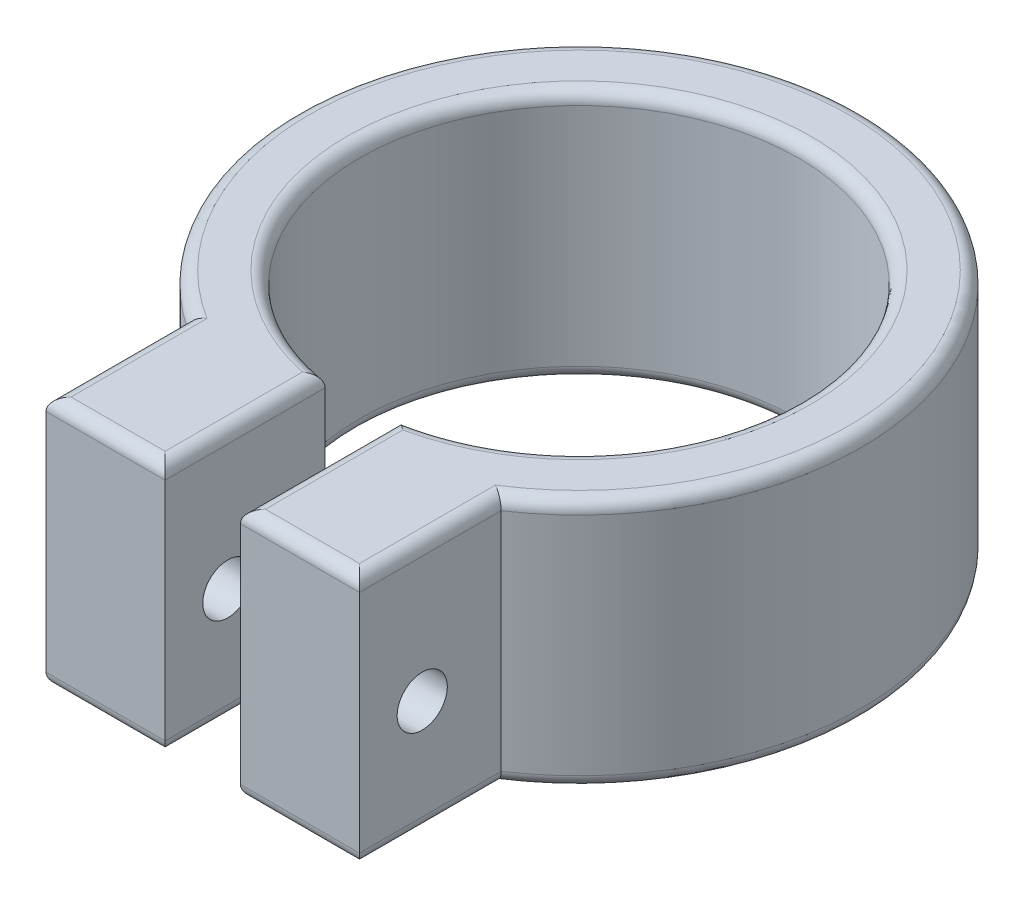
ISO-10303-21;
HEADER;
FILE_DESCRIPTION(('STEP AP214'),'2;1');
FILE_NAME('part.step','',(''),(''),'','','');
FILE_SCHEMA(('AUTOMOTIVE_DESIGN { 1 0 10303 214 1 1 1 1 }'));
ENDSEC;
DATA;
#1=APPLICATION_CONTEXT('core data for automotive mechanical design processes');
#2=APPLICATION_PROTOCOL_DEFINITION('international standard','automotive_design',2000,#1);
#3=PRODUCT_CONTEXT('',#1,'mechanical');
#4=PRODUCT('Part','Part','',(#3));
#5=PRODUCT_RELATED_PRODUCT_CATEGORY('part','',(#4));
#6=PRODUCT_DEFINITION_FORMATION('','',#4);
#7=PRODUCT_DEFINITION_CONTEXT('part definition',#1,'design');
#8=PRODUCT_DEFINITION('design','',#6,#7);
#9=PRODUCT_DEFINITION_SHAPE('','',#8);
#10=(LENGTH_UNIT() NAMED_UNIT(*) SI_UNIT(.MILLI.,.METRE.));
#11=(NAMED_UNIT(*) PLANE_ANGLE_UNIT() SI_UNIT($,.RADIAN.));
#12=(NAMED_UNIT(*) SI_UNIT($,.STERADIAN.) SOLID_ANGLE_UNIT());
#13=UNCERTAINTY_MEASURE_WITH_UNIT(LENGTH_MEASURE(1.E-05),#10,'distance_accuracy_value','');
#14=(GEOMETRIC_REPRESENTATION_CONTEXT(3) GLOBAL_UNCERTAINTY_ASSIGNED_CONTEXT((#13)) GLOBAL_UNIT_ASSIGNED_CONTEXT((#10,
#11,#12)) REPRESENTATION_CONTEXT('',''));
#15=CARTESIAN_POINT('',(0.,0.,0.));
#16=DIRECTION('',(0.,0.,1.));
#17=DIRECTION('',(1.,0.,0.));
#18=AXIS2_PLACEMENT_3D('',#15,#16,#17);
#19=CARTESIAN_POINT('',(22.5,20.,-30.));
#20=DIRECTION('',(0.,1.,0.));
#21=DIRECTION('',(0.,0.,1.));
#22=AXIS2_PLACEMENT_3D('',#19,#20,#21);
#23=PLANE('',#22);
#24=DIRECTION('',(1.,0.,0.));
#25=VECTOR('',#24,1.);
#26=CARTESIAN_POINT('',(19.5,20.,-1.));
#27=LINE('',#26,#25);
#28=CARTESIAN_POINT('',(11.,20.,-1.));
#29=VERTEX_POINT('',#28);
#30=CARTESIAN_POINT('',(18.5,20.,-1.));
#31=VERTEX_POINT('',#30);
#32=EDGE_CURVE('E443',#29,#31,#27,.T.);
#33=ORIENTED_EDGE('',*,*,#32,.T.);
#34=DIRECTION('',(0.,0.,1.));
#35=VECTOR('',#34,1.);
#36=CARTESIAN_POINT('',(18.5,20.,-12.7590603504333));
#37=LINE('',#36,#35);
#38=CARTESIAN_POINT('',(18.5,20.,-11.9376081318116));
#39=VERTEX_POINT('',#38);
#40=EDGE_CURVE('E381',#31,#39,#37,.F.);
#41=ORIENTED_EDGE('',*,*,#40,.T.);
#42=CARTESIAN_POINT('',(22.5,20.,-30.));
#43=DIRECTION('',(0.,1.,0.));
#44=DIRECTION('',(0.,0.,1.));
#45=AXIS2_PLACEMENT_3D('',#42,#43,#44);
#46=CIRCLE('',#45,18.5);
#47=CARTESIAN_POINT('',(26.5,20.,-11.9376081318116));
#48=VERTEX_POINT('',#47);
#49=EDGE_CURVE('E377',#39,#48,#46,.F.);
#50=ORIENTED_EDGE('',*,*,#49,.T.);
#51=DIRECTION('',(0.,0.,-1.));
#52=VECTOR('',#51,1.);
#53=CARTESIAN_POINT('',(26.5,20.,0.));
#54=LINE('',#53,#52);
#55=CARTESIAN_POINT('',(26.5,20.,-1.));
#56=VERTEX_POINT('',#55);
#57=EDGE_CURVE('E508',#48,#56,#54,.F.);
#58=ORIENTED_EDGE('',*,*,#57,.T.);
#59=DIRECTION('',(1.,0.,0.));
#60=VECTOR('',#59,1.);
#61=CARTESIAN_POINT('',(35.,20.,-1.));
#62=LINE('',#61,#60);
#63=CARTESIAN_POINT('',(34.,20.,-1.));
#64=VERTEX_POINT('',#63);
#65=EDGE_CURVE('E506',#56,#64,#62,.T.);
#66=ORIENTED_EDGE('',*,*,#65,.T.);
#67=DIRECTION('',(0.,0.,-1.));
#68=VECTOR('',#67,1.);
#69=CARTESIAN_POINT('',(34.,20.,-30.));
#70=LINE('',#69,#68);
#71=CARTESIAN_POINT('',(34.,20.,-11.8340978754151));
#72=VERTEX_POINT('',#71);
#73=EDGE_CURVE('E501',#64,#72,#70,.T.);
#74=ORIENTED_EDGE('',*,*,#73,.T.);
#75=CARTESIAN_POINT('',(22.5,20.,-30.));
#76=DIRECTION('',(0.,1.,0.));
#77=DIRECTION('',(0.,0.,1.));
#78=AXIS2_PLACEMENT_3D('',#75,#76,#77);
#79=CIRCLE('',#78,21.5);
#80=CARTESIAN_POINT('',(11.,20.,-11.834097875415));
#81=VERTEX_POINT('',#80);
#82=EDGE_CURVE('E495',#72,#81,#79,.T.);
#83=ORIENTED_EDGE('',*,*,#82,.T.);
#84=DIRECTION('',(0.,0.,-1.));
#85=VECTOR('',#84,1.);
#86=CARTESIAN_POINT('',(11.,20.,0.));
#87=LINE('',#86,#85);
#88=EDGE_CURVE('E499',#81,#29,#87,.F.);
#89=ORIENTED_EDGE('',*,*,#88,.T.);
#90=EDGE_LOOP('',(#33,#41,#50,#58,#66,#74,#83,#89));
#91=FACE_BOUND('',#90,.T.);
#92=ADVANCED_FACE('F51',(#91),#23,.T.);
#93=CARTESIAN_POINT('',(22.5,0.,-30.));
#94=DIRECTION('',(0.,1.,0.));
#95=DIRECTION('',(0.,0.,1.));
#96=AXIS2_PLACEMENT_3D('',#93,#94,#95);
#97=PLANE('',#96);
#98=DIRECTION('',(1.,0.,0.));
#99=VECTOR('',#98,1.);
#100=CARTESIAN_POINT('',(22.5,0.,-1.));
#101=LINE('',#100,#99);
#102=CARTESIAN_POINT('',(18.5,0.,-1.));
#103=VERTEX_POINT('',#102);
#104=CARTESIAN_POINT('',(11.,0.,-1.));
#105=VERTEX_POINT('',#104);
#106=EDGE_CURVE('E488',#103,#105,#101,.F.);
#107=ORIENTED_EDGE('',*,*,#106,.T.);
#108=DIRECTION('',(0.,0.,-1.));
#109=VECTOR('',#108,1.);
#110=CARTESIAN_POINT('',(11.,0.,-30.));
#111=LINE('',#110,#109);
#112=CARTESIAN_POINT('',(11.,0.,-11.834097875415));
#113=VERTEX_POINT('',#112);
#114=EDGE_CURVE('E493',#105,#113,#111,.T.);
#115=ORIENTED_EDGE('',*,*,#114,.T.);
#116=CARTESIAN_POINT('',(22.5,0.,-30.));
#117=DIRECTION('',(0.,1.,0.));
#118=DIRECTION('',(0.,0.,1.));
#119=AXIS2_PLACEMENT_3D('',#116,#117,#118);
#120=CIRCLE('',#119,21.5);
#121=CARTESIAN_POINT('',(34.,0.,-11.8340978754151));
#122=VERTEX_POINT('',#121);
#123=EDGE_CURVE('E483',#113,#122,#120,.F.);
#124=ORIENTED_EDGE('',*,*,#123,.T.);
#125=DIRECTION('',(0.,0.,-1.));
#126=VECTOR('',#125,1.);
#127=CARTESIAN_POINT('',(34.,0.,0.));
#128=LINE('',#127,#126);
#129=CARTESIAN_POINT('',(34.,0.,-1.));
#130=VERTEX_POINT('',#129);
#131=EDGE_CURVE('E222',#122,#130,#128,.F.);
#132=ORIENTED_EDGE('',*,*,#131,.T.);
#133=DIRECTION('',(1.,0.,0.));
#134=VECTOR('',#133,1.);
#135=CARTESIAN_POINT('',(22.5,0.,-1.));
#136=LINE('',#135,#134);
#137=CARTESIAN_POINT('',(26.5,0.,-1.));
#138=VERTEX_POINT('',#137);
#139=EDGE_CURVE('E196',#130,#138,#136,.F.);
#140=ORIENTED_EDGE('',*,*,#139,.T.);
#141=DIRECTION('',(0.,0.,-1.));
#142=VECTOR('',#141,1.);
#143=CARTESIAN_POINT('',(26.5,0.,-30.));
#144=LINE('',#143,#142);
#145=CARTESIAN_POINT('',(26.5,0.,-11.9376081318116));
#146=VERTEX_POINT('',#145);
#147=EDGE_CURVE('E211',#138,#146,#144,.T.);
#148=ORIENTED_EDGE('',*,*,#147,.T.);
#149=CARTESIAN_POINT('',(22.5,0.,-30.));
#150=DIRECTION('',(0.,1.,0.));
#151=DIRECTION('',(0.,0.,1.));
#152=AXIS2_PLACEMENT_3D('',#149,#150,#151);
#153=CIRCLE('',#152,18.5);
#154=CARTESIAN_POINT('',(18.5,0.,-11.9376081318115));
#155=VERTEX_POINT('',#154);
#156=EDGE_CURVE('E218',#146,#155,#153,.T.);
#157=ORIENTED_EDGE('',*,*,#156,.T.);
#158=DIRECTION('',(0.,0.,1.));
#159=VECTOR('',#158,1.);
#160=CARTESIAN_POINT('',(18.5,0.,-30.));
#161=LINE('',#160,#159);
#162=EDGE_CURVE('E486',#155,#103,#161,.T.);
#163=ORIENTED_EDGE('',*,*,#162,.T.);
#164=EDGE_LOOP('',(#107,#115,#124,#132,#140,#148,#157,#163));
#165=FACE_BOUND('',#164,.T.);
#166=ADVANCED_FACE('F480',(#165),#97,.F.);
#167=CARTESIAN_POINT('',(0.,20.,0.));
#168=DIRECTION('',(0.,0.,-1.));
#169=DIRECTION('',(-1.,0.,0.));
#170=AXIS2_PLACEMENT_3D('',#167,#168,#169);
#171=PLANE('',#170);
#172=DIRECTION('',(0.,1.,0.));
#173=VECTOR('',#172,1.);
#174=CARTESIAN_POINT('',(25.5,0.,0.));
#175=LINE('',#174,#173);
#176=CARTESIAN_POINT('',(25.5,1.,0.));
#177=VERTEX_POINT('',#176);
#178=CARTESIAN_POINT('',(25.5,19.,0.));
#179=VERTEX_POINT('',#178);
#180=EDGE_CURVE('E174',#177,#179,#175,.T.);
#181=ORIENTED_EDGE('',*,*,#180,.F.);
#182=DIRECTION('',(1.,0.,0.));
#183=VECTOR('',#182,1.);
#184=CARTESIAN_POINT('',(0.,1.,0.));
#185=LINE('',#184,#183);
#186=CARTESIAN_POINT('',(35.,1.,0.));
#187=VERTEX_POINT('',#186);
#188=EDGE_CURVE('E13',#177,#187,#185,.T.);
#189=ORIENTED_EDGE('',*,*,#188,.T.);
#190=DIRECTION('',(0.,1.,0.));
#191=VECTOR('',#190,1.);
#192=CARTESIAN_POINT('',(35.,0.,0.));
#193=LINE('',#192,#191);
#194=CARTESIAN_POINT('',(35.,19.,0.));
#195=VERTEX_POINT('',#194);
#196=EDGE_CURVE('E173',#187,#195,#193,.T.);
#197=ORIENTED_EDGE('',*,*,#196,.T.);
#198=DIRECTION('',(1.,0.,0.));
#199=VECTOR('',#198,1.);
#200=CARTESIAN_POINT('',(25.5,19.,0.));
#201=LINE('',#200,#199);
#202=EDGE_CURVE('E67',#195,#179,#201,.F.);
#203=ORIENTED_EDGE('',*,*,#202,.T.);
#204=EDGE_LOOP('',(#181,#189,#197,#203));
#205=FACE_BOUND('',#204,.T.);
#206=ADVANCED_FACE('F172',(#205),#171,.F.);
#207=DIRECTION('',(0.,1.,0.));
#208=VECTOR('',#207,1.);
#209=CARTESIAN_POINT('',(10.,0.,0.));
#210=LINE('',#209,#208);
#211=CARTESIAN_POINT('',(10.,1.,0.));
#212=VERTEX_POINT('',#211);
#213=CARTESIAN_POINT('',(10.,19.,0.));
#214=VERTEX_POINT('',#213);
#215=EDGE_CURVE('E415',#212,#214,#210,.T.);
#216=ORIENTED_EDGE('',*,*,#215,.F.);
#217=DIRECTION('',(1.,0.,0.));
#218=VECTOR('',#217,1.);
#219=CARTESIAN_POINT('',(0.,1.,0.));
#220=LINE('',#219,#218);
#221=CARTESIAN_POINT('',(19.5,1.,0.));
#222=VERTEX_POINT('',#221);
#223=EDGE_CURVE('E460',#212,#222,#220,.T.);
#224=ORIENTED_EDGE('',*,*,#223,.T.);
#225=DIRECTION('',(0.,1.,0.));
#226=VECTOR('',#225,1.);
#227=CARTESIAN_POINT('',(19.5,0.,0.));
#228=LINE('',#227,#226);
#229=CARTESIAN_POINT('',(19.5,19.,0.));
#230=VERTEX_POINT('',#229);
#231=EDGE_CURVE('E412',#222,#230,#228,.T.);
#232=ORIENTED_EDGE('',*,*,#231,.T.);
#233=DIRECTION('',(1.,0.,0.));
#234=VECTOR('',#233,1.);
#235=CARTESIAN_POINT('',(10.,19.,0.));
#236=LINE('',#235,#234);
#237=EDGE_CURVE('E457',#230,#214,#236,.F.);
#238=ORIENTED_EDGE('',*,*,#237,.T.);
#239=EDGE_LOOP('',(#216,#224,#232,#238));
#240=FACE_BOUND('',#239,.T.);
#241=ADVANCED_FACE('F558',(#240),#171,.F.);
#242=CARTESIAN_POINT('',(22.5,20.,-30.));
#243=DIRECTION('',(0.,-1.,0.));
#244=DIRECTION('',(0.,0.,-1.));
#245=AXIS2_PLACEMENT_3D('',#242,#243,#244);
#246=CYLINDRICAL_SURFACE('',#245,22.5);
#247=DIRECTION('',(0.,1.,0.));
#248=VECTOR('',#247,1.);
#249=CARTESIAN_POINT('',(35.,0.,-11.2917130661303));
#250=LINE('',#249,#248);
#251=CARTESIAN_POINT('',(35.,1.,-11.2917130661303));
#252=VERTEX_POINT('',#251);
#253=CARTESIAN_POINT('',(35.,19.,-11.2917130661303));
#254=VERTEX_POINT('',#253);
#255=EDGE_CURVE('E191',#252,#254,#250,.T.);
#256=ORIENTED_EDGE('',*,*,#255,.F.);
#257=CARTESIAN_POINT('',(22.5,1.,-30.));
#258=DIRECTION('',(0.,1.,0.));
#259=DIRECTION('',(0.,0.,1.));
#260=AXIS2_PLACEMENT_3D('',#257,#258,#259);
#261=CIRCLE('',#260,22.5);
#262=CARTESIAN_POINT('',(10.,1.,-11.2917130661303));
#263=VERTEX_POINT('',#262);
#264=EDGE_CURVE('E233',#252,#263,#261,.T.);
#265=ORIENTED_EDGE('',*,*,#264,.T.);
#266=DIRECTION('',(0.,1.,0.));
#267=VECTOR('',#266,1.);
#268=CARTESIAN_POINT('',(10.,0.,-11.2917130661303));
#269=LINE('',#268,#267);
#270=CARTESIAN_POINT('',(10.,19.,-11.2917130661303));
#271=VERTEX_POINT('',#270);
#272=EDGE_CURVE('E190',#263,#271,#269,.T.);
#273=ORIENTED_EDGE('',*,*,#272,.T.);
#274=CARTESIAN_POINT('',(22.5,19.,-30.));
#275=DIRECTION('',(0.,1.,0.));
#276=DIRECTION('',(0.,0.,1.));
#277=AXIS2_PLACEMENT_3D('',#274,#275,#276);
#278=CIRCLE('',#277,22.5);
#279=EDGE_CURVE('E238',#271,#254,#278,.F.);
#280=ORIENTED_EDGE('',*,*,#279,.T.);
#281=EDGE_LOOP('',(#256,#265,#273,#280));
#282=FACE_BOUND('',#281,.T.);
#283=ADVANCED_FACE('F559',(#282),#246,.T.);
#284=CARTESIAN_POINT('',(22.5,20.,-30.));
#285=DIRECTION('',(0.,-1.,0.));
#286=DIRECTION('',(0.,0.,-1.));
#287=AXIS2_PLACEMENT_3D('',#284,#285,#286);
#288=CYLINDRICAL_SURFACE('',#287,17.5);
#289=DIRECTION('',(0.,1.,0.));
#290=VECTOR('',#289,1.);
#291=CARTESIAN_POINT('',(19.5,0.,-12.7590603504333));
#292=LINE('',#291,#290);
#293=CARTESIAN_POINT('',(19.5,1.,-12.7590603504333));
#294=VERTEX_POINT('',#293);
#295=CARTESIAN_POINT('',(19.5,19.,-12.7590603504333));
#296=VERTEX_POINT('',#295);
#297=EDGE_CURVE('E213',#294,#296,#292,.T.);
#298=ORIENTED_EDGE('',*,*,#297,.F.);
#299=CARTESIAN_POINT('',(22.5,1.,-30.));
#300=DIRECTION('',(0.,1.,0.));
#301=DIRECTION('',(0.,0.,1.));
#302=AXIS2_PLACEMENT_3D('',#299,#300,#301);
#303=CIRCLE('',#302,17.5);
#304=CARTESIAN_POINT('',(25.5,1.,-12.7590603504333));
#305=VERTEX_POINT('',#304);
#306=EDGE_CURVE('E465',#294,#305,#303,.F.);
#307=ORIENTED_EDGE('',*,*,#306,.T.);
#308=DIRECTION('',(0.,1.,0.));
#309=VECTOR('',#308,1.);
#310=CARTESIAN_POINT('',(25.5,0.,-12.7590603504333));
#311=LINE('',#310,#309);
#312=CARTESIAN_POINT('',(25.5,19.,-12.7590603504333));
#313=VERTEX_POINT('',#312);
#314=EDGE_CURVE('E404',#305,#313,#311,.T.);
#315=ORIENTED_EDGE('',*,*,#314,.T.);
#316=CARTESIAN_POINT('',(22.5,19.,-30.));
#317=DIRECTION('',(0.,1.,0.));
#318=DIRECTION('',(0.,0.,1.));
#319=AXIS2_PLACEMENT_3D('',#316,#317,#318);
#320=CIRCLE('',#319,17.5);
#321=EDGE_CURVE('E376',#313,#296,#320,.T.);
#322=ORIENTED_EDGE('',*,*,#321,.T.);
#323=EDGE_LOOP('',(#298,#307,#315,#322));
#324=FACE_BOUND('',#323,.T.);
#325=ADVANCED_FACE('F471',(#324),#288,.F.);
#326=CARTESIAN_POINT('',(25.5,0.,0.));
#327=DIRECTION('',(1.,0.,0.));
#328=DIRECTION('',(0.,0.,-1.));
#329=AXIS2_PLACEMENT_3D('',#326,#327,#328);
#330=PLANE('',#329);
#331=CARTESIAN_POINT('',(25.5,9.,-5.));
#332=DIRECTION('',(1.,0.,0.));
#333=DIRECTION('',(0.,0.,-1.));
#334=AXIS2_PLACEMENT_3D('',#331,#332,#333);
#335=CIRCLE('',#334,2.);
#336=CARTESIAN_POINT('',(25.5,9.,-7.));
#337=VERTEX_POINT('',#336);
#338=EDGE_CURVE('E428',#337,#337,#335,.T.);
#339=ORIENTED_EDGE('',*,*,#338,.T.);
#340=EDGE_LOOP('',(#339));
#341=FACE_BOUND('',#340,.T.);
#342=ORIENTED_EDGE('',*,*,#180,.T.);
#343=DIRECTION('',(0.,0.,-1.));
#344=VECTOR('',#343,1.);
#345=CARTESIAN_POINT('',(25.5,19.,-12.7590603504333));
#346=LINE('',#345,#344);
#347=EDGE_CURVE('E389',#179,#313,#346,.T.);
#348=ORIENTED_EDGE('',*,*,#347,.T.);
#349=ORIENTED_EDGE('',*,*,#314,.F.);
#350=DIRECTION('',(0.,0.,-1.));
#351=VECTOR('',#350,1.);
#352=CARTESIAN_POINT('',(25.5,1.,0.));
#353=LINE('',#352,#351);
#354=EDGE_CURVE('E81',#305,#177,#353,.F.);
#355=ORIENTED_EDGE('',*,*,#354,.T.);
#356=EDGE_LOOP('',(#342,#348,#349,#355));
#357=FACE_BOUND('',#356,.T.);
#358=ADVANCED_FACE('F474',(#341,#357),#330,.F.);
#359=CARTESIAN_POINT('',(19.5,0.,0.));
#360=DIRECTION('',(-1.,0.,0.));
#361=DIRECTION('',(0.,0.,1.));
#362=AXIS2_PLACEMENT_3D('',#359,#360,#361);
#363=PLANE('',#362);
#364=CARTESIAN_POINT('',(19.5,9.,-5.));
#365=DIRECTION('',(-1.,0.,0.));
#366=DIRECTION('',(0.,0.,1.));
#367=AXIS2_PLACEMENT_3D('',#364,#365,#366);
#368=CIRCLE('',#367,2.);
#369=CARTESIAN_POINT('',(19.5,9.,-3.));
#370=VERTEX_POINT('',#369);
#371=EDGE_CURVE('E432',#370,#370,#368,.T.);
#372=ORIENTED_EDGE('',*,*,#371,.T.);
#373=EDGE_LOOP('',(#372));
#374=FACE_BOUND('',#373,.T.);
#375=ORIENTED_EDGE('',*,*,#231,.F.);
#376=DIRECTION('',(0.,0.,1.));
#377=VECTOR('',#376,1.);
#378=CARTESIAN_POINT('',(19.5,1.,0.));
#379=LINE('',#378,#377);
#380=EDGE_CURVE('E388',#222,#294,#379,.F.);
#381=ORIENTED_EDGE('',*,*,#380,.T.);
#382=ORIENTED_EDGE('',*,*,#297,.T.);
#383=DIRECTION('',(0.,0.,1.));
#384=VECTOR('',#383,1.);
#385=CARTESIAN_POINT('',(19.5,19.,0.));
#386=LINE('',#385,#384);
#387=EDGE_CURVE('E382',#296,#230,#386,.T.);
#388=ORIENTED_EDGE('',*,*,#387,.T.);
#389=EDGE_LOOP('',(#375,#381,#382,#388));
#390=FACE_BOUND('',#389,.T.);
#391=ADVANCED_FACE('F544',(#374,#390),#363,.F.);
#392=CARTESIAN_POINT('',(10.,0.,0.));
#393=DIRECTION('',(1.,0.,0.));
#394=DIRECTION('',(0.,0.,-1.));
#395=AXIS2_PLACEMENT_3D('',#392,#393,#394);
#396=PLANE('',#395);
#397=CARTESIAN_POINT('',(10.,9.,-5.));
#398=DIRECTION('',(1.,0.,0.));
#399=DIRECTION('',(0.,0.,-1.));
#400=AXIS2_PLACEMENT_3D('',#397,#398,#399);
#401=CIRCLE('',#400,2.);
#402=CARTESIAN_POINT('',(10.,9.,-7.));
#403=VERTEX_POINT('',#402);
#404=EDGE_CURVE('E436',#403,#403,#401,.T.);
#405=ORIENTED_EDGE('',*,*,#404,.T.);
#406=EDGE_LOOP('',(#405));
#407=FACE_BOUND('',#406,.T.);
#408=ORIENTED_EDGE('',*,*,#272,.F.);
#409=DIRECTION('',(0.,0.,-1.));
#410=VECTOR('',#409,1.);
#411=CARTESIAN_POINT('',(10.,1.,0.));
#412=LINE('',#411,#410);
#413=EDGE_CURVE('E454',#263,#212,#412,.F.);
#414=ORIENTED_EDGE('',*,*,#413,.T.);
#415=ORIENTED_EDGE('',*,*,#215,.T.);
#416=DIRECTION('',(0.,0.,-1.));
#417=VECTOR('',#416,1.);
#418=CARTESIAN_POINT('',(10.,19.,-11.2917130661303));
#419=LINE('',#418,#417);
#420=EDGE_CURVE('E450',#214,#271,#419,.T.);
#421=ORIENTED_EDGE('',*,*,#420,.T.);
#422=EDGE_LOOP('',(#408,#414,#415,#421));
#423=FACE_BOUND('',#422,.T.);
#424=ADVANCED_FACE('F539',(#407,#423),#396,.F.);
#425=CARTESIAN_POINT('',(35.,0.,0.));
#426=DIRECTION('',(1.,0.,0.));
#427=DIRECTION('',(0.,0.,-1.));
#428=AXIS2_PLACEMENT_3D('',#425,#426,#427);
#429=PLANE('',#428);
#430=CARTESIAN_POINT('',(35.,9.,-5.));
#431=DIRECTION('',(1.,0.,0.));
#432=DIRECTION('',(0.,0.,-1.));
#433=AXIS2_PLACEMENT_3D('',#430,#431,#432);
#434=CIRCLE('',#433,2.);
#435=CARTESIAN_POINT('',(35.,9.,-7.));
#436=VERTEX_POINT('',#435);
#437=EDGE_CURVE('E441',#436,#436,#434,.T.);
#438=ORIENTED_EDGE('',*,*,#437,.F.);
#439=EDGE_LOOP('',(#438));
#440=FACE_BOUND('',#439,.T.);
#441=ORIENTED_EDGE('',*,*,#196,.F.);
#442=DIRECTION('',(0.,0.,-1.));
#443=VECTOR('',#442,1.);
#444=CARTESIAN_POINT('',(35.,1.,-11.2917130661303));
#445=LINE('',#444,#443);
#446=EDGE_CURVE('E185',#187,#252,#445,.T.);
#447=ORIENTED_EDGE('',*,*,#446,.T.);
#448=ORIENTED_EDGE('',*,*,#255,.T.);
#449=DIRECTION('',(0.,0.,-1.));
#450=VECTOR('',#449,1.);
#451=CARTESIAN_POINT('',(35.,19.,0.));
#452=LINE('',#451,#450);
#453=EDGE_CURVE('E188',#254,#195,#452,.F.);
#454=ORIENTED_EDGE('',*,*,#453,.T.);
#455=EDGE_LOOP('',(#441,#447,#448,#454));
#456=FACE_BOUND('',#455,.T.);
#457=ADVANCED_FACE('F182',(#440,#456),#429,.T.);
#458=CARTESIAN_POINT('',(18.5,1.,-30.));
#459=DIRECTION('',(0.,0.,1.));
#460=DIRECTION('',(1.,0.,0.));
#461=AXIS2_PLACEMENT_3D('',#458,#459,#460);
#462=CYLINDRICAL_SURFACE('',#461,1.);
#463=CARTESIAN_POINT('',(18.5,1.,-1.));
#464=DIRECTION('',(-0.707106781186547,0.,0.707106781186547));
#465=DIRECTION('',(0.707106781186547,0.,0.707106781186547));
#466=AXIS2_PLACEMENT_3D('',#463,#464,#465);
#467=ELLIPSE('',#466,1.41421356237309,1.);
#468=EDGE_CURVE('E285',#103,#222,#467,.T.);
#469=ORIENTED_EDGE('',*,*,#468,.F.);
#470=ORIENTED_EDGE('',*,*,#162,.F.);
#471=CARTESIAN_POINT('',(19.5,1.,-12.7590603504333));
#472=CARTESIAN_POINT('',(19.5000025658507,0.976449769797416,-12.7590626497976));
#473=CARTESIAN_POINT('',(19.4991673909643,0.952913138809122,-12.7583600959621));
#474=CARTESIAN_POINT('',(19.4958537268471,0.906052324938436,-12.7555735123984));
#475=CARTESIAN_POINT('',(19.493376244743,0.882728020729837,-12.7534903293261));
#476=CARTESIAN_POINT('',(19.4835791351943,0.813675436744314,-12.7452546686449));
#477=CARTESIAN_POINT('',(19.4738936773669,0.768488128191731,-12.737115063092));
#478=CARTESIAN_POINT('',(19.4488594271133,0.681038909015151,-12.7161004273433));
#479=CARTESIAN_POINT('',(19.4335223050801,0.638771181686502,-12.7032351555762));
#480=CARTESIAN_POINT('',(19.3980003135747,0.557783167417089,-12.6734823864909));
#481=CARTESIAN_POINT('',(19.377806523937,0.519069591245115,-12.6565874884997));
#482=CARTESIAN_POINT('',(19.3260331042962,0.433488677976039,-12.6133486260151));
#483=CARTESIAN_POINT('',(19.2929017545144,0.388203278029624,-12.5857320140369));
#484=CARTESIAN_POINT('',(19.2213441214772,0.305251866450627,-12.5262508566829));
#485=CARTESIAN_POINT('',(19.1829091175301,0.267598661358038,-12.494379317883));
#486=CARTESIAN_POINT('',(19.0910202689877,0.190546901669668,-12.4184125112253));
#487=CARTESIAN_POINT('',(19.0363495046644,0.153536299896097,-12.3733717350668));
#488=CARTESIAN_POINT('',(18.9229325110231,0.0915340661668184,-12.2803180881187));
#489=CARTESIAN_POINT('',(18.8641838046828,0.0665498136578796,-12.232303412865));
#490=CARTESIAN_POINT('',(18.7554269901498,0.0318143816189406,-12.1437909462707));
#491=CARTESIAN_POINT('',(18.7058185017399,0.0200974359410088,-12.1035505306955));
#492=CARTESIAN_POINT('',(18.6058122334049,0.00433016441434542,-12.0227067403859));
#493=CARTESIAN_POINT('',(18.5554162832088,0.000264146667052162,-11.9821042805311));
#494=CARTESIAN_POINT('',(18.5033274534333,4.15173117882072E-06,-11.9402794687239));
#495=CARTESIAN_POINT('',(18.5016637351532,-2.65108599427396E-10,-11.9389437324615));
#496=CARTESIAN_POINT('',(18.5,0.,-11.9376081318115));
#497=B_SPLINE_CURVE_WITH_KNOTS('',3,(#471,#472,#473,#474,#475,#476,#477,#478,#479,#480,#481,
#482,#483,#484,#485,#486,#487,#488,#489,#490,#491,#492,#493,#494,#495,#496),.UNSPECIFIED.,.F.,
.F.,(4,2,2,2,2,2,2,2,2,2,2,2,4),(0.,0.0705994498664318,0.141155645397856,0.281146900307328,
0.420850685798021,0.560813049375829,0.74741644311827,0.934330404641157,1.17284634935761,
1.41150846304465,1.60590893791551,1.79991026490768,1.80631098819992),.UNSPECIFIED.);
#498=EDGE_CURVE('E298',#294,#155,#497,.T.);
#499=ORIENTED_EDGE('',*,*,#498,.F.);
#500=ORIENTED_EDGE('',*,*,#380,.F.);
#501=EDGE_LOOP('',(#469,#470,#499,#500));
#502=FACE_BOUND('',#501,.T.);
#503=ADVANCED_FACE('F294',(#502),#462,.T.);
#504=CARTESIAN_POINT('',(22.5,1.,-30.));
#505=DIRECTION('',(0.,1.,0.));
#506=DIRECTION('',(0.,0.,1.));
#507=AXIS2_PLACEMENT_3D('',#504,#505,#506);
#508=TOROIDAL_SURFACE('',#507,18.5,1.);
#509=ORIENTED_EDGE('',*,*,#498,.T.);
#510=ORIENTED_EDGE('',*,*,#156,.F.);
#511=CARTESIAN_POINT('',(25.5,1.,-12.7590603504333));
#512=CARTESIAN_POINT('',(25.4999974341493,0.976449769797416,-12.7590626497976));
#513=CARTESIAN_POINT('',(25.5008326090357,0.952913138809123,-12.7583600959621));
#514=CARTESIAN_POINT('',(25.5041462731529,0.906052324938436,-12.7555735123985));
#515=CARTESIAN_POINT('',(25.506623755257,0.882728020729837,-12.7534903293261));
#516=CARTESIAN_POINT('',(25.5164208648057,0.813675436744313,-12.7452546686449));
#517=CARTESIAN_POINT('',(25.5261063226331,0.76848812819173,-12.737115063092));
#518=CARTESIAN_POINT('',(25.5511405728867,0.68103890901515,-12.7161004273433));
#519=CARTESIAN_POINT('',(25.5664776949199,0.638771181686502,-12.7032351555762));
#520=CARTESIAN_POINT('',(25.6019996864253,0.557783167417089,-12.6734823864909));
#521=CARTESIAN_POINT('',(25.622193476063,0.519069591245115,-12.6565874884997));
#522=CARTESIAN_POINT('',(25.6739668957038,0.433488677976038,-12.6133486260151));
#523=CARTESIAN_POINT('',(25.7070982454856,0.388203278029621,-12.585732014037));
#524=CARTESIAN_POINT('',(25.7786558785227,0.305251866450625,-12.5262508566829));
#525=CARTESIAN_POINT('',(25.8170908824699,0.267598661358038,-12.494379317883));
#526=CARTESIAN_POINT('',(25.9089797310123,0.19054690166967,-12.4184125112253));
#527=CARTESIAN_POINT('',(25.9636504953356,0.153536299896098,-12.3733717350669));
#528=CARTESIAN_POINT('',(26.0770674889769,0.0915340661668187,-12.2803180881187));
#529=CARTESIAN_POINT('',(26.1358161953172,0.0665498136578799,-12.232303412865));
#530=CARTESIAN_POINT('',(26.2445730098502,0.0318143816189409,-12.1437909462708));
#531=CARTESIAN_POINT('',(26.2941814982601,0.0200974359410088,-12.1035505306956));
#532=CARTESIAN_POINT('',(26.394187766595,0.00433016441434587,-12.0227067403859));
#533=CARTESIAN_POINT('',(26.444583716791,0.000264146667053343,-11.9821042805309));
#534=CARTESIAN_POINT('',(26.4966725465667,4.15173117889514E-06,-11.9402794687239));
#535=CARTESIAN_POINT('',(26.4983362648468,-2.65108562237526E-10,-11.9389437324615));
#536=CARTESIAN_POINT('',(26.5,0.,-11.9376081318116));
#537=B_SPLINE_CURVE_WITH_KNOTS('',3,(#511,#512,#513,#514,#515,#516,#517,#518,#519,#520,#521,
#522,#523,#524,#525,#526,#527,#528,#529,#530,#531,#532,#533,#534,#535,#536),.UNSPECIFIED.,.F.,
.F.,(4,2,2,2,2,2,2,2,2,2,2,2,4),(0.,0.0705994498664313,0.141155645397856,0.281146900307328,
0.420850685798022,0.56081304937583,0.747416443118274,0.934330404641158,1.17284634935761,
1.41150846304465,1.60590893791551,1.79991026490768,1.80631098819992),.UNSPECIFIED.);
#538=EDGE_CURVE('E275',#305,#146,#537,.T.);
#539=ORIENTED_EDGE('',*,*,#538,.F.);
#540=ORIENTED_EDGE('',*,*,#306,.F.);
#541=EDGE_LOOP('',(#509,#510,#539,#540));
#542=FACE_BOUND('',#541,.T.);
#543=ADVANCED_FACE('F289',(#542),#508,.T.);
#544=CARTESIAN_POINT('',(0.,1.,-1.));
#545=DIRECTION('',(1.,0.,0.));
#546=DIRECTION('',(0.,0.,-1.));
#547=AXIS2_PLACEMENT_3D('',#544,#545,#546);
#548=CYLINDRICAL_SURFACE('',#547,1.);
#549=ORIENTED_EDGE('',*,*,#468,.T.);
#550=ORIENTED_EDGE('',*,*,#223,.F.);
#551=CARTESIAN_POINT('',(11.,1.,-1.));
#552=DIRECTION('',(0.707106781186547,0.,0.707106781186547));
#553=DIRECTION('',(0.707106781186547,0.,-0.707106781186547));
#554=AXIS2_PLACEMENT_3D('',#551,#552,#553);
#555=ELLIPSE('',#554,1.41421356237309,1.);
#556=EDGE_CURVE('E271',#105,#212,#555,.F.);
#557=ORIENTED_EDGE('',*,*,#556,.F.);
#558=ORIENTED_EDGE('',*,*,#106,.F.);
#559=EDGE_LOOP('',(#549,#550,#557,#558));
#560=FACE_BOUND('',#559,.T.);
#561=ADVANCED_FACE('F293',(#560),#548,.T.);
#562=CARTESIAN_POINT('',(26.5,1.,-30.));
#563=DIRECTION('',(0.,0.,-1.));
#564=DIRECTION('',(-1.,0.,0.));
#565=AXIS2_PLACEMENT_3D('',#562,#563,#564);
#566=CYLINDRICAL_SURFACE('',#565,1.);
#567=ORIENTED_EDGE('',*,*,#538,.T.);
#568=ORIENTED_EDGE('',*,*,#147,.F.);
#569=CARTESIAN_POINT('',(26.5,1.,-1.));
#570=DIRECTION('',(0.707106781186547,0.,0.707106781186547));
#571=DIRECTION('',(0.707106781186547,0.,-0.707106781186547));
#572=AXIS2_PLACEMENT_3D('',#569,#570,#571);
#573=ELLIPSE('',#572,1.41421356237309,1.);
#574=EDGE_CURVE('E268',#177,#138,#573,.T.);
#575=ORIENTED_EDGE('',*,*,#574,.F.);
#576=ORIENTED_EDGE('',*,*,#354,.F.);
#577=EDGE_LOOP('',(#567,#568,#575,#576));
#578=FACE_BOUND('',#577,.T.);
#579=ADVANCED_FACE('F287',(#578),#566,.T.);
#580=CARTESIAN_POINT('',(11.,1.,-30.));
#581=DIRECTION('',(0.,0.,-1.));
#582=DIRECTION('',(-1.,0.,0.));
#583=AXIS2_PLACEMENT_3D('',#580,#581,#582);
#584=CYLINDRICAL_SURFACE('',#583,1.);
#585=ORIENTED_EDGE('',*,*,#556,.T.);
#586=ORIENTED_EDGE('',*,*,#413,.F.);
#587=CARTESIAN_POINT('',(10.,1.,-11.2917130661303));
#588=CARTESIAN_POINT('',(9.99999865062423,0.974260576704979,-11.2917124194473));
#589=CARTESIAN_POINT('',(10.0009945203584,0.94853443826045,-11.2922446524394));
#590=CARTESIAN_POINT('',(10.0049572125351,0.897285444796985,-11.2943629501197));
#591=CARTESIAN_POINT('',(10.0079234639002,0.871762533045094,-11.2959487094635));
#592=CARTESIAN_POINT('',(10.019706733136,0.795977326246986,-11.302249226699));
#593=CARTESIAN_POINT('',(10.0314087702982,0.746255575926794,-11.3085074823518));
#594=CARTESIAN_POINT('',(10.0619551422121,0.649808314939695,-11.324857085741));
#595=CARTESIAN_POINT('',(10.0807946779016,0.603080815645887,-11.3349458579509));
#596=CARTESIAN_POINT('',(10.1248233063412,0.513633735851627,-11.3585496066096));
#597=CARTESIAN_POINT('',(10.1500167633413,0.470916937926409,-11.3720669380328));
#598=CARTESIAN_POINT('',(10.207087061625,0.388514251089495,-11.4027285977908));
#599=CARTESIAN_POINT('',(10.2392159530103,0.349054880883616,-11.420010031846));
#600=CARTESIAN_POINT('',(10.3082936594198,0.276073606849721,-11.4572258536197));
#601=CARTESIAN_POINT('',(10.3452437718942,0.242553307045146,-11.4771609555022));
#602=CARTESIAN_POINT('',(10.4272722954268,0.178423729110041,-11.5214963309839));
#603=CARTESIAN_POINT('',(10.4727975905805,0.148559745928609,-11.5461466376586));
#604=CARTESIAN_POINT('',(10.5672323663719,0.0968868859656289,-11.5973912190105));
#605=CARTESIAN_POINT('',(10.6161448741415,0.075085327764219,-11.6239872337848));
#606=CARTESIAN_POINT('',(10.7192314355317,0.0385726338717903,-11.6801689902717));
#607=CARTESIAN_POINT('',(10.7735438166401,0.0243832934135907,-11.7098379101227));
#608=CARTESIAN_POINT('',(10.8832602730356,0.00528257394285024,-11.7699233664019));
#609=CARTESIAN_POINT('',(10.9386618278624,0.00035185494460104,-11.8003382096721));
#610=CARTESIAN_POINT('',(10.9959816546648,6.04430715022765E-06,-11.8318859492413));
#611=CARTESIAN_POINT('',(10.9979909040331,-1.11039988105801E-08,-11.8329919035537));
#612=CARTESIAN_POINT('',(11.,0.,-11.834097875415));
#613=B_SPLINE_CURVE_WITH_KNOTS('',3,(#587,#588,#589,#590,#591,#592,#593,#594,#595,#596,#597,
#598,#599,#600,#601,#602,#603,#604,#605,#606,#607,#608,#609,#610,#611,#612),.UNSPECIFIED.,.F.,
.F.,(4,2,2,2,2,2,2,2,2,2,2,2,4),(0.,0.0771675962328046,0.15431283666862,0.30788425016037,
0.461352589089995,0.614926627632162,0.775492233344101,0.936101138710809,1.11467945812771,
1.29341948450512,1.48321188641437,1.67260739518599,1.67948793092146),.UNSPECIFIED.);
#614=EDGE_CURVE('E201',#113,#263,#613,.F.);
#615=ORIENTED_EDGE('',*,*,#614,.F.);
#616=ORIENTED_EDGE('',*,*,#114,.F.);
#617=EDGE_LOOP('',(#585,#586,#615,#616));
#618=FACE_BOUND('',#617,.T.);
#619=ADVANCED_FACE('F257',(#618),#584,.T.);
#620=CARTESIAN_POINT('',(0.,1.,-1.));
#621=DIRECTION('',(1.,0.,0.));
#622=DIRECTION('',(0.,0.,-1.));
#623=AXIS2_PLACEMENT_3D('',#620,#621,#622);
#624=CYLINDRICAL_SURFACE('',#623,1.);
#625=ORIENTED_EDGE('',*,*,#574,.T.);
#626=ORIENTED_EDGE('',*,*,#139,.F.);
#627=CARTESIAN_POINT('',(34.,1.,-1.));
#628=DIRECTION('',(0.707106781186547,0.,-0.707106781186547));
#629=DIRECTION('',(0.707106781186547,0.,0.707106781186547));
#630=AXIS2_PLACEMENT_3D('',#627,#628,#629);
#631=ELLIPSE('',#630,1.41421356237309,1.);
#632=EDGE_CURVE('E194',#187,#130,#631,.T.);
#633=ORIENTED_EDGE('',*,*,#632,.F.);
#634=ORIENTED_EDGE('',*,*,#188,.F.);
#635=EDGE_LOOP('',(#625,#626,#633,#634));
#636=FACE_BOUND('',#635,.T.);
#637=ADVANCED_FACE('F195',(#636),#624,.T.);
#638=CARTESIAN_POINT('',(22.5,1.,-30.));
#639=DIRECTION('',(0.,1.,0.));
#640=DIRECTION('',(0.,0.,1.));
#641=AXIS2_PLACEMENT_3D('',#638,#639,#640);
#642=TOROIDAL_SURFACE('',#641,21.5,1.);
#643=ORIENTED_EDGE('',*,*,#614,.T.);
#644=ORIENTED_EDGE('',*,*,#264,.F.);
#645=CARTESIAN_POINT('',(35.,1.,-11.2917130661303));
#646=CARTESIAN_POINT('',(35.0000013493758,0.974260576704979,-11.2917124194473));
#647=CARTESIAN_POINT('',(34.9990054796416,0.94853443826045,-11.2922446524394));
#648=CARTESIAN_POINT('',(34.9950427874649,0.897285444796984,-11.2943629501197));
#649=CARTESIAN_POINT('',(34.9920765360998,0.871762533045093,-11.2959487094635));
#650=CARTESIAN_POINT('',(34.980293266864,0.795977326246985,-11.302249226699));
#651=CARTESIAN_POINT('',(34.9685912297018,0.746255575926795,-11.3085074823518));
#652=CARTESIAN_POINT('',(34.9380448577879,0.649808314939696,-11.324857085741));
#653=CARTESIAN_POINT('',(34.9192053220984,0.603080815645887,-11.3349458579509));
#654=CARTESIAN_POINT('',(34.8751766936588,0.513633735851626,-11.3585496066096));
#655=CARTESIAN_POINT('',(34.8499832366587,0.470916937926407,-11.3720669380328));
#656=CARTESIAN_POINT('',(34.792912938375,0.388514251089494,-11.4027285977908));
#657=CARTESIAN_POINT('',(34.7607840469897,0.349054880883616,-11.4200100318461));
#658=CARTESIAN_POINT('',(34.6917063405802,0.276073606849719,-11.4572258536197));
#659=CARTESIAN_POINT('',(34.6547562281058,0.242553307045143,-11.4771609555022));
#660=CARTESIAN_POINT('',(34.5727277045732,0.178423729110038,-11.5214963309839));
#661=CARTESIAN_POINT('',(34.5272024094195,0.148559745928606,-11.5461466376586));
#662=CARTESIAN_POINT('',(34.4327676336281,0.0968868859656273,-11.5973912190105));
#663=CARTESIAN_POINT('',(34.3838551258585,0.0750853277642183,-11.6239872337848));
#664=CARTESIAN_POINT('',(34.2807685644683,0.0385726338717899,-11.6801689902717));
#665=CARTESIAN_POINT('',(34.2264561833599,0.0243832934135902,-11.7098379101227));
#666=CARTESIAN_POINT('',(34.1167397269645,0.00528257394284965,-11.769923366402));
#667=CARTESIAN_POINT('',(34.0613381721376,0.000351854944600663,-11.8003382096722));
#668=CARTESIAN_POINT('',(34.0040183453351,6.04430715022337E-06,-11.8318859492413));
#669=CARTESIAN_POINT('',(34.0020090959669,-1.11039988023781E-08,-11.8329919035537));
#670=CARTESIAN_POINT('',(34.,0.,-11.8340978754151));
#671=B_SPLINE_CURVE_WITH_KNOTS('',3,(#645,#646,#647,#648,#649,#650,#651,#652,#653,#654,#655,
#656,#657,#658,#659,#660,#661,#662,#663,#664,#665,#666,#667,#668,#669,#670),.UNSPECIFIED.,.F.,
.F.,(4,2,2,2,2,2,2,2,2,2,2,2,4),(0.,0.0771675962328051,0.15431283666862,0.30788425016037,
0.461352589089992,0.614926627632162,0.775492233344105,0.936101138710811,1.11467945812772,
1.29341948450512,1.48321188641438,1.67260739518599,1.67948793092146),.UNSPECIFIED.);
#672=EDGE_CURVE('E202',#122,#252,#671,.F.);
#673=ORIENTED_EDGE('',*,*,#672,.F.);
#674=ORIENTED_EDGE('',*,*,#123,.F.);
#675=EDGE_LOOP('',(#643,#644,#673,#674));
#676=FACE_BOUND('',#675,.T.);
#677=ADVANCED_FACE('F252',(#676),#642,.T.);
#678=CARTESIAN_POINT('',(34.,1.,0.));
#679=DIRECTION('',(0.,0.,1.));
#680=DIRECTION('',(1.,0.,0.));
#681=AXIS2_PLACEMENT_3D('',#678,#679,#680);
#682=CYLINDRICAL_SURFACE('',#681,1.);
#683=ORIENTED_EDGE('',*,*,#632,.T.);
#684=ORIENTED_EDGE('',*,*,#131,.F.);
#685=ORIENTED_EDGE('',*,*,#672,.T.);
#686=ORIENTED_EDGE('',*,*,#446,.F.);
#687=EDGE_LOOP('',(#683,#684,#685,#686));
#688=FACE_BOUND('',#687,.T.);
#689=ADVANCED_FACE('F204',(#688),#682,.T.);
#690=CARTESIAN_POINT('',(18.5,19.,0.));
#691=DIRECTION('',(0.,0.,-1.));
#692=DIRECTION('',(-1.,0.,0.));
#693=AXIS2_PLACEMENT_3D('',#690,#691,#692);
#694=CYLINDRICAL_SURFACE('',#693,1.);
#695=CARTESIAN_POINT('',(18.5,19.,-1.));
#696=DIRECTION('',(0.707106781186547,0.,-0.707106781186547));
#697=DIRECTION('',(-0.707106781186547,0.,-0.707106781186547));
#698=AXIS2_PLACEMENT_3D('',#695,#696,#697);
#699=ELLIPSE('',#698,1.41421356237309,1.);
#700=EDGE_CURVE('E362',#230,#31,#699,.F.);
#701=ORIENTED_EDGE('',*,*,#700,.F.);
#702=ORIENTED_EDGE('',*,*,#387,.F.);
#703=CARTESIAN_POINT('',(19.5,19.,-12.7590603504333));
#704=CARTESIAN_POINT('',(19.5000025658507,19.0235502302026,-12.7590626497976));
#705=CARTESIAN_POINT('',(19.4991673909643,19.0470868611909,-12.7583600959621));
#706=CARTESIAN_POINT('',(19.4958537268471,19.0939476750616,-12.7555735123985));
#707=CARTESIAN_POINT('',(19.493376244743,19.1172719792702,-12.7534903293261));
#708=CARTESIAN_POINT('',(19.4835791351943,19.1863245632557,-12.7452546686449));
#709=CARTESIAN_POINT('',(19.4738936773669,19.2315118718083,-12.737115063092));
#710=CARTESIAN_POINT('',(19.4488594271133,19.3189610909848,-12.7161004273433));
#711=CARTESIAN_POINT('',(19.4335223050801,19.3612288183135,-12.7032351555762));
#712=CARTESIAN_POINT('',(19.3980003135747,19.4422168325829,-12.6734823864909));
#713=CARTESIAN_POINT('',(19.377806523937,19.4809304087549,-12.6565874884997));
#714=CARTESIAN_POINT('',(19.3260331042962,19.566511322024,-12.6133486260151));
#715=CARTESIAN_POINT('',(19.2929017545144,19.6117967219704,-12.5857320140369));
#716=CARTESIAN_POINT('',(19.2213441214772,19.6947481335494,-12.5262508566829));
#717=CARTESIAN_POINT('',(19.1829091175301,19.732401338642,-12.494379317883));
#718=CARTESIAN_POINT('',(19.0910202689877,19.8094530983303,-12.4184125112253));
#719=CARTESIAN_POINT('',(19.0363495046644,19.8464637001039,-12.3733717350668));
#720=CARTESIAN_POINT('',(18.9229325110231,19.9084659338332,-12.2803180881187));
#721=CARTESIAN_POINT('',(18.8641838046827,19.9334501863421,-12.2323034128651));
#722=CARTESIAN_POINT('',(18.7554269901499,19.9681856183811,-12.1437909462707));
#723=CARTESIAN_POINT('',(18.7058185017402,19.979902564059,-12.1035505306952));
#724=CARTESIAN_POINT('',(18.6058122334047,19.9956698355857,-12.0227067403862));
#725=CARTESIAN_POINT('',(18.555416283208,19.9997358533329,-11.9821042805322));
#726=CARTESIAN_POINT('',(18.5033274534332,19.9999958482688,-11.940279468724));
#727=CARTESIAN_POINT('',(18.5016637351532,20.0000000002651,-11.9389437324615));
#728=CARTESIAN_POINT('',(18.5,20.,-11.9376081318116));
#729=B_SPLINE_CURVE_WITH_KNOTS('',3,(#703,#704,#705,#706,#707,#708,#709,#710,#711,#712,#713,
#714,#715,#716,#717,#718,#719,#720,#721,#722,#723,#724,#725,#726,#727,#728),.UNSPECIFIED.,.F.,
.F.,(4,2,2,2,2,2,2,2,2,2,2,2,4),(0.,0.0705994498664303,0.141155645397854,0.281146900307327,
0.420850685798016,0.560813049375829,0.747416443118268,0.934330404641154,1.17284634935762,
1.41150846304465,1.60590893791551,1.79991026490768,1.80631098819992),.UNSPECIFIED.);
#730=EDGE_CURVE('E56',#39,#296,#729,.F.);
#731=ORIENTED_EDGE('',*,*,#730,.F.);
#732=ORIENTED_EDGE('',*,*,#40,.F.);
#733=EDGE_LOOP('',(#701,#702,#731,#732));
#734=FACE_BOUND('',#733,.T.);
#735=ADVANCED_FACE('F53',(#734),#694,.T.);
#736=CARTESIAN_POINT('',(22.5,19.,-30.));
#737=DIRECTION('',(0.,1.,0.));
#738=DIRECTION('',(0.,0.,1.));
#739=AXIS2_PLACEMENT_3D('',#736,#737,#738);
#740=TOROIDAL_SURFACE('',#739,18.5,1.);
#741=ORIENTED_EDGE('',*,*,#730,.T.);
#742=ORIENTED_EDGE('',*,*,#321,.F.);
#743=CARTESIAN_POINT('',(25.5,19.,-12.7590603504333));
#744=CARTESIAN_POINT('',(25.4999974341493,19.0235502302026,-12.7590626497976));
#745=CARTESIAN_POINT('',(25.5008326090357,19.0470868611909,-12.7583600959621));
#746=CARTESIAN_POINT('',(25.5041462731529,19.0939476750616,-12.7555735123985));
#747=CARTESIAN_POINT('',(25.506623755257,19.1172719792702,-12.7534903293261));
#748=CARTESIAN_POINT('',(25.5164208648057,19.1863245632557,-12.7452546686449));
#749=CARTESIAN_POINT('',(25.5261063226331,19.2315118718083,-12.737115063092));
#750=CARTESIAN_POINT('',(25.5511405728867,19.3189610909848,-12.7161004273433));
#751=CARTESIAN_POINT('',(25.5664776949199,19.3612288183135,-12.7032351555762));
#752=CARTESIAN_POINT('',(25.6019996864253,19.4422168325829,-12.6734823864909));
#753=CARTESIAN_POINT('',(25.622193476063,19.4809304087549,-12.6565874884997));
#754=CARTESIAN_POINT('',(25.6739668957038,19.566511322024,-12.6133486260151));
#755=CARTESIAN_POINT('',(25.7070982454856,19.6117967219704,-12.5857320140369));
#756=CARTESIAN_POINT('',(25.7786558785227,19.6947481335494,-12.5262508566829));
#757=CARTESIAN_POINT('',(25.8170908824699,19.732401338642,-12.494379317883));
#758=CARTESIAN_POINT('',(25.9089797310123,19.8094530983303,-12.4184125112253));
#759=CARTESIAN_POINT('',(25.9636504953356,19.8464637001039,-12.3733717350668));
#760=CARTESIAN_POINT('',(26.0770674889769,19.9084659338332,-12.2803180881187));
#761=CARTESIAN_POINT('',(26.1358161953173,19.9334501863421,-12.2323034128651));
#762=CARTESIAN_POINT('',(26.2445730098501,19.9681856183811,-12.1437909462707));
#763=CARTESIAN_POINT('',(26.2941814982598,19.979902564059,-12.1035505306952));
#764=CARTESIAN_POINT('',(26.3941877665953,19.9956698355857,-12.0227067403862));
#765=CARTESIAN_POINT('',(26.444583716792,19.9997358533329,-11.9821042805322));
#766=CARTESIAN_POINT('',(26.4966725465668,19.9999958482688,-11.940279468724));
#767=CARTESIAN_POINT('',(26.4983362648468,20.0000000002651,-11.9389437324615));
#768=CARTESIAN_POINT('',(26.5,20.,-11.9376081318116));
#769=B_SPLINE_CURVE_WITH_KNOTS('',3,(#743,#744,#745,#746,#747,#748,#749,#750,#751,#752,#753,
#754,#755,#756,#757,#758,#759,#760,#761,#762,#763,#764,#765,#766,#767,#768),.UNSPECIFIED.,.F.,
.F.,(4,2,2,2,2,2,2,2,2,2,2,2,4),(0.,0.0705994498664304,0.141155645397857,0.281146900307329,
0.420850685798024,0.560813049375834,0.747416443118277,0.934330404641157,1.17284634935762,
1.41150846304465,1.6059089379155,1.79991026490768,1.80631098819993),.UNSPECIFIED.);
#770=EDGE_CURVE('E355',#48,#313,#769,.F.);
#771=ORIENTED_EDGE('',*,*,#770,.F.);
#772=ORIENTED_EDGE('',*,*,#49,.F.);
#773=EDGE_LOOP('',(#741,#742,#771,#772));
#774=FACE_BOUND('',#773,.T.);
#775=ADVANCED_FACE('F346',(#774),#740,.T.);
#776=CARTESIAN_POINT('',(22.5,19.,-1.));
#777=DIRECTION('',(-1.,0.,0.));
#778=DIRECTION('',(0.,0.,1.));
#779=AXIS2_PLACEMENT_3D('',#776,#777,#778);
#780=CYLINDRICAL_SURFACE('',#779,1.);
#781=ORIENTED_EDGE('',*,*,#700,.T.);
#782=ORIENTED_EDGE('',*,*,#32,.F.);
#783=CARTESIAN_POINT('',(11.,19.,-1.));
#784=DIRECTION('',(-0.707106781186547,0.,-0.707106781186547));
#785=DIRECTION('',(-0.707106781186547,0.,0.707106781186547));
#786=AXIS2_PLACEMENT_3D('',#783,#784,#785);
#787=ELLIPSE('',#786,1.41421356237309,1.);
#788=EDGE_CURVE('E363',#214,#29,#787,.T.);
#789=ORIENTED_EDGE('',*,*,#788,.F.);
#790=ORIENTED_EDGE('',*,*,#237,.F.);
#791=EDGE_LOOP('',(#781,#782,#789,#790));
#792=FACE_BOUND('',#791,.T.);
#793=ADVANCED_FACE('F350',(#792),#780,.T.);
#794=CARTESIAN_POINT('',(26.5,19.,0.));
#795=DIRECTION('',(0.,0.,1.));
#796=DIRECTION('',(1.,0.,0.));
#797=AXIS2_PLACEMENT_3D('',#794,#795,#796);
#798=CYLINDRICAL_SURFACE('',#797,1.);
#799=ORIENTED_EDGE('',*,*,#770,.T.);
#800=ORIENTED_EDGE('',*,*,#347,.F.);
#801=CARTESIAN_POINT('',(26.5,19.,-1.));
#802=DIRECTION('',(-0.707106781186547,0.,-0.707106781186547));
#803=DIRECTION('',(-0.707106781186547,0.,0.707106781186547));
#804=AXIS2_PLACEMENT_3D('',#801,#802,#803);
#805=ELLIPSE('',#804,1.41421356237309,1.);
#806=EDGE_CURVE('E335',#56,#179,#805,.F.);
#807=ORIENTED_EDGE('',*,*,#806,.F.);
#808=ORIENTED_EDGE('',*,*,#57,.F.);
#809=EDGE_LOOP('',(#799,#800,#807,#808));
#810=FACE_BOUND('',#809,.T.);
#811=ADVANCED_FACE('F342',(#810),#798,.T.);
#812=CARTESIAN_POINT('',(11.,19.,0.));
#813=DIRECTION('',(0.,0.,1.));
#814=DIRECTION('',(1.,0.,0.));
#815=AXIS2_PLACEMENT_3D('',#812,#813,#814);
#816=CYLINDRICAL_SURFACE('',#815,1.);
#817=ORIENTED_EDGE('',*,*,#788,.T.);
#818=ORIENTED_EDGE('',*,*,#88,.F.);
#819=CARTESIAN_POINT('',(10.,19.,-11.2917130661303));
#820=CARTESIAN_POINT('',(9.99999865062423,19.025739423295,-11.2917124194473));
#821=CARTESIAN_POINT('',(10.0009945203584,19.0514655617396,-11.2922446524394));
#822=CARTESIAN_POINT('',(10.0049572125351,19.102714555203,-11.2943629501197));
#823=CARTESIAN_POINT('',(10.0079234639002,19.1282374669549,-11.2959487094635));
#824=CARTESIAN_POINT('',(10.019706733136,19.204022673753,-11.302249226699));
#825=CARTESIAN_POINT('',(10.0314087702982,19.2537444240732,-11.3085074823518));
#826=CARTESIAN_POINT('',(10.0619551422121,19.3501916850603,-11.324857085741));
#827=CARTESIAN_POINT('',(10.0807946779016,19.3969191843541,-11.3349458579509));
#828=CARTESIAN_POINT('',(10.1248233063412,19.4863662641484,-11.3585496066096));
#829=CARTESIAN_POINT('',(10.1500167633413,19.5290830620736,-11.3720669380328));
#830=CARTESIAN_POINT('',(10.207087061625,19.6114857489105,-11.4027285977908));
#831=CARTESIAN_POINT('',(10.2392159530102,19.6509451191164,-11.420010031846));
#832=CARTESIAN_POINT('',(10.3082936594198,19.7239263931503,-11.4572258536197));
#833=CARTESIAN_POINT('',(10.3452437718942,19.7574466929549,-11.4771609555022));
#834=CARTESIAN_POINT('',(10.4272722954268,19.82157627089,-11.5214963309839));
#835=CARTESIAN_POINT('',(10.4727975905805,19.8514402540714,-11.5461466376586));
#836=CARTESIAN_POINT('',(10.5672323663719,19.9031131140344,-11.5973912190105));
#837=CARTESIAN_POINT('',(10.6161448741415,19.9249146722358,-11.6239872337847));
#838=CARTESIAN_POINT('',(10.7192314355316,19.9614273661282,-11.6801689902718));
#839=CARTESIAN_POINT('',(10.7735438166399,19.9756167065864,-11.709837910123));
#840=CARTESIAN_POINT('',(10.8832602730357,19.9947174260572,-11.7699233664016));
#841=CARTESIAN_POINT('',(10.938661827863,19.9996481450554,-11.8003382096709));
#842=CARTESIAN_POINT('',(10.9959816546649,19.9999939556929,-11.8318859492412));
#843=CARTESIAN_POINT('',(10.9979909040331,20.000000011104,-11.8329919035537));
#844=CARTESIAN_POINT('',(11.,20.,-11.834097875415));
#845=B_SPLINE_CURVE_WITH_KNOTS('',3,(#819,#820,#821,#822,#823,#824,#825,#826,#827,#828,#829,
#830,#831,#832,#833,#834,#835,#836,#837,#838,#839,#840,#841,#842,#843,#844),.UNSPECIFIED.,.F.,
.F.,(4,2,2,2,2,2,2,2,2,2,2,2,4),(0.,0.0771675962328053,0.15431283666862,0.307884250160369,
0.461352589089995,0.614926627632159,0.775492233344101,0.936101138710809,1.11467945812771,
1.29341948450512,1.48321188641437,1.67260739518599,1.67948793092146),.UNSPECIFIED.);
#846=EDGE_CURVE('E327',#271,#81,#845,.T.);
#847=ORIENTED_EDGE('',*,*,#846,.F.);
#848=ORIENTED_EDGE('',*,*,#420,.F.);
#849=EDGE_LOOP('',(#817,#818,#847,#848));
#850=FACE_BOUND('',#849,.T.);
#851=ADVANCED_FACE('F338',(#850),#816,.T.);
#852=CARTESIAN_POINT('',(22.5,19.,-1.));
#853=DIRECTION('',(-1.,0.,0.));
#854=DIRECTION('',(0.,0.,1.));
#855=AXIS2_PLACEMENT_3D('',#852,#853,#854);
#856=CYLINDRICAL_SURFACE('',#855,1.);
#857=ORIENTED_EDGE('',*,*,#806,.T.);
#858=ORIENTED_EDGE('',*,*,#202,.F.);
#859=CARTESIAN_POINT('',(34.,19.,-1.));
#860=DIRECTION('',(-0.707106781186547,0.,0.707106781186547));
#861=DIRECTION('',(-0.707106781186547,0.,-0.707106781186547));
#862=AXIS2_PLACEMENT_3D('',#859,#860,#861);
#863=ELLIPSE('',#862,1.41421356237309,1.);
#864=EDGE_CURVE('E336',#64,#195,#863,.F.);
#865=ORIENTED_EDGE('',*,*,#864,.F.);
#866=ORIENTED_EDGE('',*,*,#65,.F.);
#867=EDGE_LOOP('',(#857,#858,#865,#866));
#868=FACE_BOUND('',#867,.T.);
#869=ADVANCED_FACE('F321',(#868),#856,.T.);
#870=CARTESIAN_POINT('',(22.5,19.,-30.));
#871=DIRECTION('',(0.,1.,0.));
#872=DIRECTION('',(0.,0.,1.));
#873=AXIS2_PLACEMENT_3D('',#870,#871,#872);
#874=TOROIDAL_SURFACE('',#873,21.5,1.);
#875=ORIENTED_EDGE('',*,*,#846,.T.);
#876=ORIENTED_EDGE('',*,*,#82,.F.);
#877=CARTESIAN_POINT('',(35.,19.,-11.2917130661303));
#878=CARTESIAN_POINT('',(35.0000013493758,19.025739423295,-11.2917124194473));
#879=CARTESIAN_POINT('',(34.9990054796416,19.0514655617396,-11.2922446524394));
#880=CARTESIAN_POINT('',(34.9950427874649,19.102714555203,-11.2943629501197));
#881=CARTESIAN_POINT('',(34.9920765360998,19.1282374669549,-11.2959487094635));
#882=CARTESIAN_POINT('',(34.980293266864,19.204022673753,-11.302249226699));
#883=CARTESIAN_POINT('',(34.9685912297018,19.2537444240732,-11.3085074823518));
#884=CARTESIAN_POINT('',(34.9380448577879,19.3501916850603,-11.324857085741));
#885=CARTESIAN_POINT('',(34.9192053220984,19.3969191843541,-11.3349458579509));
#886=CARTESIAN_POINT('',(34.8751766936588,19.4863662641484,-11.3585496066096));
#887=CARTESIAN_POINT('',(34.8499832366587,19.5290830620736,-11.3720669380328));
#888=CARTESIAN_POINT('',(34.792912938375,19.6114857489105,-11.4027285977908));
#889=CARTESIAN_POINT('',(34.7607840469897,19.6509451191164,-11.4200100318461));
#890=CARTESIAN_POINT('',(34.6917063405802,19.7239263931503,-11.4572258536197));
#891=CARTESIAN_POINT('',(34.6547562281058,19.7574466929549,-11.4771609555022));
#892=CARTESIAN_POINT('',(34.5727277045732,19.82157627089,-11.5214963309839));
#893=CARTESIAN_POINT('',(34.5272024094195,19.8514402540714,-11.5461466376587));
#894=CARTESIAN_POINT('',(34.4327676336281,19.9031131140344,-11.5973912190105));
#895=CARTESIAN_POINT('',(34.3838551258584,19.9249146722358,-11.6239872337847));
#896=CARTESIAN_POINT('',(34.2807685644684,19.9614273661282,-11.6801689902718));
#897=CARTESIAN_POINT('',(34.2264561833601,19.9756167065864,-11.7098379101231));
#898=CARTESIAN_POINT('',(34.1167397269642,19.9947174260572,-11.7699233664016));
#899=CARTESIAN_POINT('',(34.0613381721368,19.9996481450554,-11.8003382096707));
#900=CARTESIAN_POINT('',(34.0040183453351,19.9999939556929,-11.8318859492412));
#901=CARTESIAN_POINT('',(34.0020090959669,20.000000011104,-11.8329919035537));
#902=CARTESIAN_POINT('',(34.,20.,-11.8340978754151));
#903=B_SPLINE_CURVE_WITH_KNOTS('',3,(#877,#878,#879,#880,#881,#882,#883,#884,#885,#886,#887,
#888,#889,#890,#891,#892,#893,#894,#895,#896,#897,#898,#899,#900,#901,#902),.UNSPECIFIED.,.F.,
.F.,(4,2,2,2,2,2,2,2,2,2,2,2,4),(0.,0.0771675962328054,0.154312836668616,0.307884250160369,
0.461352589090001,0.614926627632165,0.775492233344096,0.936101138710809,1.11467945812772,
1.29341948450512,1.48321188641437,1.67260739518598,1.67948793092146),.UNSPECIFIED.);
#904=EDGE_CURVE('E306',#254,#72,#903,.T.);
#905=ORIENTED_EDGE('',*,*,#904,.F.);
#906=ORIENTED_EDGE('',*,*,#279,.F.);
#907=EDGE_LOOP('',(#875,#876,#905,#906));
#908=FACE_BOUND('',#907,.T.);
#909=ADVANCED_FACE('F317',(#908),#874,.T.);
#910=CARTESIAN_POINT('',(34.,19.,-30.));
#911=DIRECTION('',(0.,0.,-1.));
#912=DIRECTION('',(-1.,0.,0.));
#913=AXIS2_PLACEMENT_3D('',#910,#911,#912);
#914=CYLINDRICAL_SURFACE('',#913,1.);
#915=ORIENTED_EDGE('',*,*,#864,.T.);
#916=ORIENTED_EDGE('',*,*,#453,.F.);
#917=ORIENTED_EDGE('',*,*,#904,.T.);
#918=ORIENTED_EDGE('',*,*,#73,.F.);
#919=EDGE_LOOP('',(#915,#916,#917,#918));
#920=FACE_BOUND('',#919,.T.);
#921=ADVANCED_FACE('F320',(#920),#914,.T.);
#922=CARTESIAN_POINT('',(5.99999999999999,9.,-5.));
#923=DIRECTION('',(1.,0.,0.));
#924=DIRECTION('',(0.,0.,-1.));
#925=AXIS2_PLACEMENT_3D('',#922,#923,#924);
#926=CYLINDRICAL_SURFACE('',#925,2.);
#927=ORIENTED_EDGE('',*,*,#437,.T.);
#928=EDGE_LOOP('',(#927));
#929=FACE_BOUND('',#928,.T.);
#930=ORIENTED_EDGE('',*,*,#338,.F.);
#931=EDGE_LOOP('',(#930));
#932=FACE_BOUND('',#931,.T.);
#933=ADVANCED_FACE('F535',(#929,#932),#926,.F.);
#934=ORIENTED_EDGE('',*,*,#404,.F.);
#935=EDGE_LOOP('',(#934));
#936=FACE_BOUND('',#935,.T.);
#937=ORIENTED_EDGE('',*,*,#371,.F.);
#938=EDGE_LOOP('',(#937));
#939=FACE_BOUND('',#938,.T.);
#940=ADVANCED_FACE('F590',(#936,#939),#926,.F.);
#941=CLOSED_SHELL('',(#92,#166,#206,#241,#283,#325,#358,#391,#424,#457,#503,#543,#561,#579,#619,
#637,#677,#689,#735,#775,#793,#811,#851,#869,#909,#921,#933,#940));
#942=MANIFOLD_SOLID_BREP('B2',#941);
#943=ADVANCED_BREP_SHAPE_REPRESENTATION('',(#18,#942),#14);
#944=SHAPE_DEFINITION_REPRESENTATION(#9,#943);
ENDSEC;
END-ISO-10303-21;
